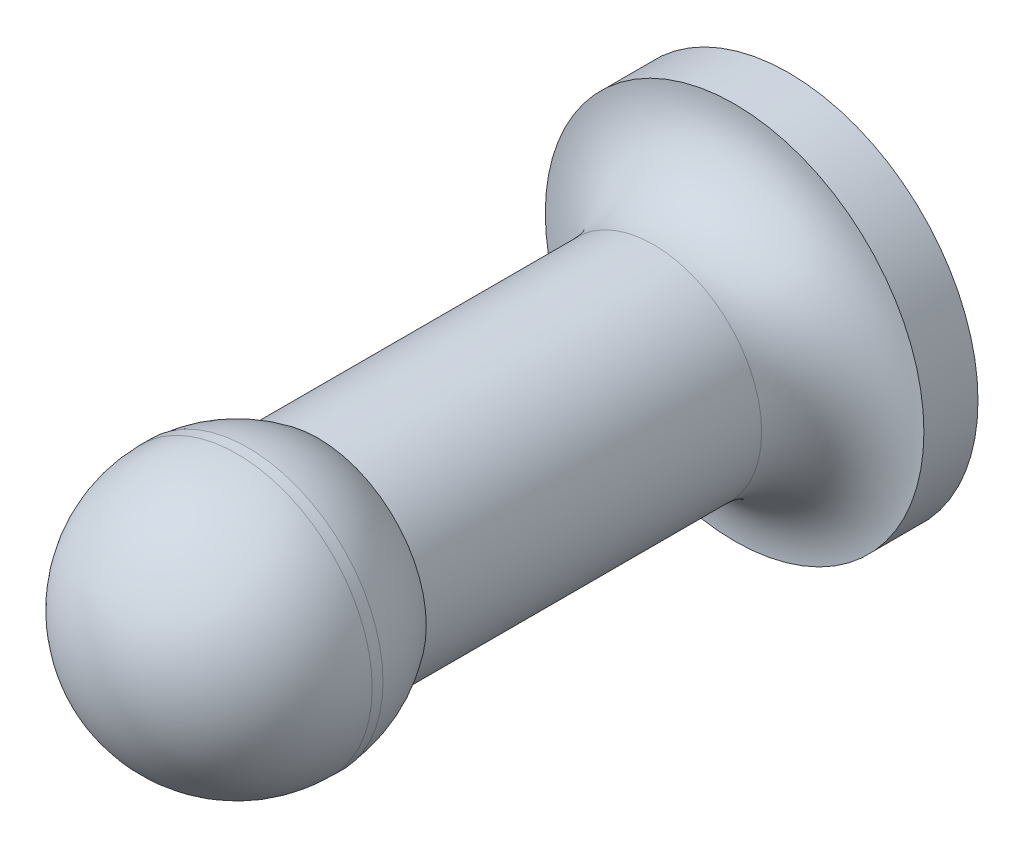
ISO-10303-21;
HEADER;
FILE_DESCRIPTION(('STEP AP214'),'2;1');
FILE_NAME('part.step','',(''),(''),'','','');
FILE_SCHEMA(('AUTOMOTIVE_DESIGN { 1 0 10303 214 1 1 1 1 }'));
ENDSEC;
DATA;
#1=APPLICATION_CONTEXT('core data for automotive mechanical design processes');
#2=APPLICATION_PROTOCOL_DEFINITION('international standard','automotive_design',2000,#1);
#3=PRODUCT_CONTEXT('',#1,'mechanical');
#4=PRODUCT('Part','Part','',(#3));
#5=PRODUCT_RELATED_PRODUCT_CATEGORY('part','',(#4));
#6=PRODUCT_DEFINITION_FORMATION('','',#4);
#7=PRODUCT_DEFINITION_CONTEXT('part definition',#1,'design');
#8=PRODUCT_DEFINITION('design','',#6,#7);
#9=PRODUCT_DEFINITION_SHAPE('','',#8);
#10=(LENGTH_UNIT() NAMED_UNIT(*) SI_UNIT(.MILLI.,.METRE.));
#11=(NAMED_UNIT(*) PLANE_ANGLE_UNIT() SI_UNIT($,.RADIAN.));
#12=(NAMED_UNIT(*) SI_UNIT($,.STERADIAN.) SOLID_ANGLE_UNIT());
#13=UNCERTAINTY_MEASURE_WITH_UNIT(LENGTH_MEASURE(1.E-05),#10,'distance_accuracy_value','');
#14=(GEOMETRIC_REPRESENTATION_CONTEXT(3) GLOBAL_UNCERTAINTY_ASSIGNED_CONTEXT((#13)) GLOBAL_UNIT_ASSIGNED_CONTEXT((#10,
#11,#12)) REPRESENTATION_CONTEXT('',''));
#15=CARTESIAN_POINT('',(0.,0.,0.));
#16=DIRECTION('',(0.,0.,1.));
#17=DIRECTION('',(1.,0.,0.));
#18=AXIS2_PLACEMENT_3D('',#15,#16,#17);
#19=CARTESIAN_POINT('',(0.,0.,5.));
#20=DIRECTION('',(0.,0.,-1.));
#21=DIRECTION('',(-1.,0.,0.));
#22=AXIS2_PLACEMENT_3D('',#19,#20,#21);
#23=CYLINDRICAL_SURFACE('',#22,17.5);
#24=CARTESIAN_POINT('',(0.,0.,5.));
#25=DIRECTION('',(0.,0.,1.));
#26=DIRECTION('',(1.,0.,0.));
#27=AXIS2_PLACEMENT_3D('',#24,#25,#26);
#28=CIRCLE('',#27,17.5);
#29=CARTESIAN_POINT('',(17.5,0.,5.));
#30=VERTEX_POINT('',#29);
#31=EDGE_CURVE('E43',#30,#30,#28,.T.);
#32=ORIENTED_EDGE('',*,*,#31,.F.);
#33=EDGE_LOOP('',(#32));
#34=FACE_BOUND('',#33,.T.);
#35=CARTESIAN_POINT('',(0.,0.,0.));
#36=DIRECTION('',(0.,0.,1.));
#37=DIRECTION('',(1.,0.,0.));
#38=AXIS2_PLACEMENT_3D('',#35,#36,#37);
#39=CIRCLE('',#38,17.5);
#40=CARTESIAN_POINT('',(17.5,0.,0.));
#41=VERTEX_POINT('',#40);
#42=EDGE_CURVE('E47',#41,#41,#39,.T.);
#43=ORIENTED_EDGE('',*,*,#42,.T.);
#44=EDGE_LOOP('',(#43));
#45=FACE_BOUND('',#44,.T.);
#46=ADVANCED_FACE('F36',(#34,#45),#23,.T.);
#47=CARTESIAN_POINT('',(0.,0.,0.));
#48=DIRECTION('',(0.,0.,1.));
#49=DIRECTION('',(1.,0.,0.));
#50=AXIS2_PLACEMENT_3D('',#47,#48,#49);
#51=PLANE('',#50);
#52=ORIENTED_EDGE('',*,*,#42,.F.);
#53=EDGE_LOOP('',(#52));
#54=FACE_BOUND('',#53,.T.);
#55=ADVANCED_FACE('F89',(#54),#51,.F.);
#56=CARTESIAN_POINT('',(0.,0.,50.));
#57=DIRECTION('',(0.,0.,-1.));
#58=DIRECTION('',(-1.,0.,0.));
#59=AXIS2_PLACEMENT_3D('',#56,#57,#58);
#60=CYLINDRICAL_SURFACE('',#59,10.);
#61=CARTESIAN_POINT('',(0.,0.,12.5));
#62=DIRECTION('',(0.,0.,1.));
#63=DIRECTION('',(1.,0.,0.));
#64=AXIS2_PLACEMENT_3D('',#61,#62,#63);
#65=CIRCLE('',#64,10.);
#66=CARTESIAN_POINT('',(10.,0.,12.5));
#67=VERTEX_POINT('',#66);
#68=EDGE_CURVE('E10',#67,#67,#65,.T.);
#69=ORIENTED_EDGE('',*,*,#68,.T.);
#70=EDGE_LOOP('',(#69));
#71=FACE_BOUND('',#70,.T.);
#72=CARTESIAN_POINT('',(0.,0.,43.5));
#73=DIRECTION('',(0.,0.,1.));
#74=DIRECTION('',(1.,0.,0.));
#75=AXIS2_PLACEMENT_3D('',#72,#73,#74);
#76=CIRCLE('',#75,10.);
#77=CARTESIAN_POINT('',(10.,0.,43.5));
#78=VERTEX_POINT('',#77);
#79=EDGE_CURVE('E59',#78,#78,#76,.F.);
#80=ORIENTED_EDGE('',*,*,#79,.T.);
#81=EDGE_LOOP('',(#80));
#82=FACE_BOUND('',#81,.T.);
#83=ADVANCED_FACE('F85',(#71,#82),#60,.T.);
#84=CARTESIAN_POINT('',(0.,0.,51.));
#85=DIRECTION('',(0.,1.,0.));
#86=DIRECTION('',(1.,0.,0.));
#87=AXIS2_PLACEMENT_3D('',#84,#85,#86);
#88=SPHERICAL_SURFACE('',#87,12.5);
#89=CARTESIAN_POINT('',(0.,0.,51.));
#90=DIRECTION('',(0.,0.,1.));
#91=DIRECTION('',(1.,0.,0.));
#92=AXIS2_PLACEMENT_3D('',#89,#90,#91);
#93=SPHERICAL_SURFACE('',#92,12.5);
#94=CARTESIAN_POINT('',(0.,0.,50.));
#95=DIRECTION('',(0.,0.,1.));
#96=DIRECTION('',(1.,0.,0.));
#97=AXIS2_PLACEMENT_3D('',#94,#95,#96);
#98=CIRCLE('',#97,12.4599357943771);
#99=CARTESIAN_POINT('',(12.4599357943771,0.,50.));
#100=VERTEX_POINT('',#99);
#101=EDGE_CURVE('E57',#100,#100,#98,.T.);
#102=ORIENTED_EDGE('',*,*,#101,.F.);
#103=EDGE_LOOP('',(#102));
#104=FACE_BOUND('',#103,.T.);
#105=ORIENTED_EDGE('',*,*,#79,.F.);
#106=EDGE_LOOP('',(#105));
#107=FACE_BOUND('',#106,.T.);
#108=ADVANCED_FACE('F80',(#104,#107),#93,.T.);
#109=CARTESIAN_POINT('',(0.,0.,50.));
#110=DIRECTION('',(0.,0.,1.));
#111=DIRECTION('',(1.,0.,0.));
#112=AXIS2_PLACEMENT_3D('',#109,#110,#111);
#113=PLANE('',#112);
#114=ORIENTED_EDGE('',*,*,#101,.T.);
#115=EDGE_LOOP('',(#114));
#116=FACE_BOUND('',#115,.T.);
#117=CARTESIAN_POINT('',(0.,0.,50.));
#118=DIRECTION('',(0.,0.,1.));
#119=DIRECTION('',(1.,0.,0.));
#120=AXIS2_PLACEMENT_3D('',#117,#118,#119);
#121=CIRCLE('',#120,12.5);
#122=CARTESIAN_POINT('',(12.5,0.,50.));
#123=VERTEX_POINT('',#122);
#124=EDGE_CURVE('E55',#123,#123,#121,.T.);
#125=ORIENTED_EDGE('',*,*,#124,.F.);
#126=EDGE_LOOP('',(#125));
#127=FACE_BOUND('',#126,.T.);
#128=ADVANCED_FACE('F75',(#116,#127),#113,.F.);
#129=CARTESIAN_POINT('',(0.,0.,51.));
#130=DIRECTION('',(0.,0.,-1.));
#131=DIRECTION('',(-1.,0.,0.));
#132=AXIS2_PLACEMENT_3D('',#129,#130,#131);
#133=CYLINDRICAL_SURFACE('',#132,12.5);
#134=CARTESIAN_POINT('',(0.,0.,51.));
#135=DIRECTION('',(0.,0.,1.));
#136=DIRECTION('',(1.,0.,0.));
#137=AXIS2_PLACEMENT_3D('',#134,#135,#136);
#138=CIRCLE('',#137,12.5);
#139=CARTESIAN_POINT('',(12.5,0.,51.));
#140=VERTEX_POINT('',#139);
#141=EDGE_CURVE('E52',#140,#140,#138,.T.);
#142=ORIENTED_EDGE('',*,*,#141,.F.);
#143=EDGE_LOOP('',(#142));
#144=FACE_BOUND('',#143,.T.);
#145=ORIENTED_EDGE('',*,*,#124,.T.);
#146=EDGE_LOOP('',(#145));
#147=FACE_BOUND('',#146,.T.);
#148=ADVANCED_FACE('F72',(#144,#147),#133,.T.);
#149=CARTESIAN_POINT('',(0.,0.,51.));
#150=DIRECTION('',(0.,0.,1.));
#151=DIRECTION('',(1.,0.,0.));
#152=AXIS2_PLACEMENT_3D('',#149,#150,#151);
#153=SPHERICAL_SURFACE('',#152,12.5);
#154=ORIENTED_EDGE('',*,*,#141,.T.);
#155=EDGE_LOOP('',(#154));
#156=FACE_BOUND('',#155,.T.);
#157=ADVANCED_FACE('F70',(#156),#153,.T.);
#158=CARTESIAN_POINT('',(0.,0.,12.5));
#159=DIRECTION('',(0.,0.,1.));
#160=DIRECTION('',(1.,0.,0.));
#161=AXIS2_PLACEMENT_3D('',#158,#159,#160);
#162=TOROIDAL_SURFACE('',#161,17.5,7.5);
#163=ORIENTED_EDGE('',*,*,#68,.F.);
#164=EDGE_LOOP('',(#163));
#165=FACE_BOUND('',#164,.T.);
#166=ORIENTED_EDGE('',*,*,#31,.T.);
#167=EDGE_LOOP('',(#166));
#168=FACE_BOUND('',#167,.T.);
#169=ADVANCED_FACE('F38',(#165,#168),#162,.F.);
#170=CLOSED_SHELL('',(#46,#55,#83,#108,#128,#148,#157,#169));
#171=MANIFOLD_SOLID_BREP('B2',#170);
#172=ADVANCED_BREP_SHAPE_REPRESENTATION('',(#18,#171),#14);
#173=SHAPE_DEFINITION_REPRESENTATION(#9,#172);
ENDSEC;
END-ISO-10303-21;
